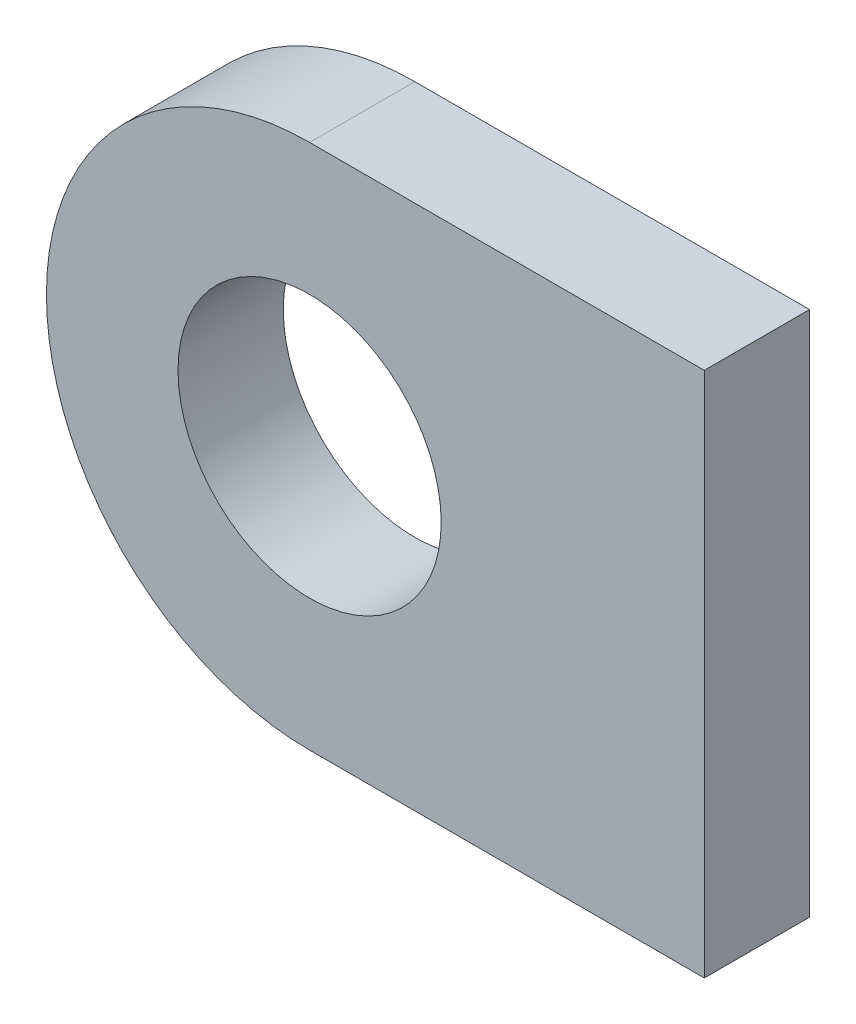
ISO-10303-21;
HEADER;
FILE_DESCRIPTION(('STEP AP214'),'2;1');
FILE_NAME('part.step','',(''),(''),'','','');
FILE_SCHEMA(('AUTOMOTIVE_DESIGN { 1 0 10303 214 1 1 1 1 }'));
ENDSEC;
DATA;
#1=APPLICATION_CONTEXT('core data for automotive mechanical design processes');
#2=APPLICATION_PROTOCOL_DEFINITION('international standard','automotive_design',2000,#1);
#3=PRODUCT_CONTEXT('',#1,'mechanical');
#4=PRODUCT('Part','Part','',(#3));
#5=PRODUCT_RELATED_PRODUCT_CATEGORY('part','',(#4));
#6=PRODUCT_DEFINITION_FORMATION('','',#4);
#7=PRODUCT_DEFINITION_CONTEXT('part definition',#1,'design');
#8=PRODUCT_DEFINITION('design','',#6,#7);
#9=PRODUCT_DEFINITION_SHAPE('','',#8);
#10=(LENGTH_UNIT() NAMED_UNIT(*) SI_UNIT(.MILLI.,.METRE.));
#11=(NAMED_UNIT(*) PLANE_ANGLE_UNIT() SI_UNIT($,.RADIAN.));
#12=(NAMED_UNIT(*) SI_UNIT($,.STERADIAN.) SOLID_ANGLE_UNIT());
#13=UNCERTAINTY_MEASURE_WITH_UNIT(LENGTH_MEASURE(1.E-05),#10,'distance_accuracy_value','');
#14=(GEOMETRIC_REPRESENTATION_CONTEXT(3) GLOBAL_UNCERTAINTY_ASSIGNED_CONTEXT((#13)) GLOBAL_UNIT_ASSIGNED_CONTEXT((#10,
#11,#12)) REPRESENTATION_CONTEXT('',''));
#15=CARTESIAN_POINT('',(0.,0.,0.));
#16=DIRECTION('',(0.,0.,1.));
#17=DIRECTION('',(1.,0.,0.));
#18=AXIS2_PLACEMENT_3D('',#15,#16,#17);
#19=CARTESIAN_POINT('',(0.,0.,4.));
#20=DIRECTION('',(0.,0.,-1.));
#21=DIRECTION('',(-1.,0.,0.));
#22=AXIS2_PLACEMENT_3D('',#19,#20,#21);
#23=CYLINDRICAL_SURFACE('',#22,10.);
#24=CARTESIAN_POINT('',(0.,0.,0.));
#25=DIRECTION('',(0.,0.,1.));
#26=DIRECTION('',(1.,0.,0.));
#27=AXIS2_PLACEMENT_3D('',#24,#25,#26);
#28=CIRCLE('',#27,10.);
#29=CARTESIAN_POINT('',(0.,10.,0.));
#30=VERTEX_POINT('',#29);
#31=CARTESIAN_POINT('',(0.,-10.,0.));
#32=VERTEX_POINT('',#31);
#33=EDGE_CURVE('E114',#30,#32,#28,.T.);
#34=ORIENTED_EDGE('',*,*,#33,.T.);
#35=DIRECTION('',(0.,0.,-1.));
#36=VECTOR('',#35,1.);
#37=CARTESIAN_POINT('',(0.,-10.,4.));
#38=LINE('',#37,#36);
#39=CARTESIAN_POINT('',(0.,-10.,4.));
#40=VERTEX_POINT('',#39);
#41=EDGE_CURVE('E11',#40,#32,#38,.T.);
#42=ORIENTED_EDGE('',*,*,#41,.F.);
#43=CARTESIAN_POINT('',(0.,0.,4.));
#44=DIRECTION('',(0.,0.,1.));
#45=DIRECTION('',(1.,0.,0.));
#46=AXIS2_PLACEMENT_3D('',#43,#44,#45);
#47=CIRCLE('',#46,10.);
#48=CARTESIAN_POINT('',(0.,10.,4.));
#49=VERTEX_POINT('',#48);
#50=EDGE_CURVE('E83',#49,#40,#47,.T.);
#51=ORIENTED_EDGE('',*,*,#50,.F.);
#52=DIRECTION('',(0.,0.,-1.));
#53=VECTOR('',#52,1.);
#54=CARTESIAN_POINT('',(0.,10.,4.));
#55=LINE('',#54,#53);
#56=EDGE_CURVE('E59',#49,#30,#55,.T.);
#57=ORIENTED_EDGE('',*,*,#56,.T.);
#58=EDGE_LOOP('',(#34,#42,#51,#57));
#59=FACE_BOUND('',#58,.T.);
#60=ADVANCED_FACE('F41',(#59),#23,.T.);
#61=CARTESIAN_POINT('',(0.,-10.,4.));
#62=DIRECTION('',(0.,-1.,0.));
#63=DIRECTION('',(0.,0.,-1.));
#64=AXIS2_PLACEMENT_3D('',#61,#62,#63);
#65=PLANE('',#64);
#66=DIRECTION('',(-1.,0.,0.));
#67=VECTOR('',#66,1.);
#68=CARTESIAN_POINT('',(0.,-10.,0.));
#69=LINE('',#68,#67);
#70=CARTESIAN_POINT('',(15.,-10.,0.));
#71=VERTEX_POINT('',#70);
#72=EDGE_CURVE('E92',#71,#32,#69,.T.);
#73=ORIENTED_EDGE('',*,*,#72,.F.);
#74=DIRECTION('',(0.,0.,-1.));
#75=VECTOR('',#74,1.);
#76=CARTESIAN_POINT('',(15.,-10.,4.));
#77=LINE('',#76,#75);
#78=CARTESIAN_POINT('',(15.,-10.,4.));
#79=VERTEX_POINT('',#78);
#80=EDGE_CURVE('E51',#79,#71,#77,.T.);
#81=ORIENTED_EDGE('',*,*,#80,.F.);
#82=DIRECTION('',(-1.,0.,0.));
#83=VECTOR('',#82,1.);
#84=CARTESIAN_POINT('',(0.,-10.,4.));
#85=LINE('',#84,#83);
#86=EDGE_CURVE('E90',#79,#40,#85,.T.);
#87=ORIENTED_EDGE('',*,*,#86,.T.);
#88=ORIENTED_EDGE('',*,*,#41,.T.);
#89=EDGE_LOOP('',(#73,#81,#87,#88));
#90=FACE_BOUND('',#89,.T.);
#91=ADVANCED_FACE('F89',(#90),#65,.T.);
#92=CARTESIAN_POINT('',(15.,0.,4.));
#93=DIRECTION('',(1.,0.,0.));
#94=DIRECTION('',(0.,0.,-1.));
#95=AXIS2_PLACEMENT_3D('',#92,#93,#94);
#96=PLANE('',#95);
#97=DIRECTION('',(0.,-1.,0.));
#98=VECTOR('',#97,1.);
#99=CARTESIAN_POINT('',(15.,0.,0.));
#100=LINE('',#99,#98);
#101=CARTESIAN_POINT('',(15.,10.,0.));
#102=VERTEX_POINT('',#101);
#103=EDGE_CURVE('E119',#102,#71,#100,.T.);
#104=ORIENTED_EDGE('',*,*,#103,.F.);
#105=DIRECTION('',(0.,0.,-1.));
#106=VECTOR('',#105,1.);
#107=CARTESIAN_POINT('',(15.,10.,4.));
#108=LINE('',#107,#106);
#109=CARTESIAN_POINT('',(15.,10.,4.));
#110=VERTEX_POINT('',#109);
#111=EDGE_CURVE('E72',#110,#102,#108,.T.);
#112=ORIENTED_EDGE('',*,*,#111,.F.);
#113=DIRECTION('',(0.,-1.,0.));
#114=VECTOR('',#113,1.);
#115=CARTESIAN_POINT('',(15.,0.,4.));
#116=LINE('',#115,#114);
#117=EDGE_CURVE('E99',#110,#79,#116,.T.);
#118=ORIENTED_EDGE('',*,*,#117,.T.);
#119=ORIENTED_EDGE('',*,*,#80,.T.);
#120=EDGE_LOOP('',(#104,#112,#118,#119));
#121=FACE_BOUND('',#120,.T.);
#122=ADVANCED_FACE('F102',(#121),#96,.T.);
#123=CARTESIAN_POINT('',(0.,0.,4.));
#124=DIRECTION('',(0.,0.,-1.));
#125=DIRECTION('',(-1.,0.,0.));
#126=AXIS2_PLACEMENT_3D('',#123,#124,#125);
#127=CYLINDRICAL_SURFACE('',#126,5.);
#128=CARTESIAN_POINT('',(0.,0.,4.));
#129=DIRECTION('',(0.,0.,1.));
#130=DIRECTION('',(1.,0.,0.));
#131=AXIS2_PLACEMENT_3D('',#128,#129,#130);
#132=CIRCLE('',#131,5.);
#133=CARTESIAN_POINT('',(5.,0.,4.));
#134=VERTEX_POINT('',#133);
#135=EDGE_CURVE('E126',#134,#134,#132,.T.);
#136=ORIENTED_EDGE('',*,*,#135,.T.);
#137=EDGE_LOOP('',(#136));
#138=FACE_BOUND('',#137,.T.);
#139=CARTESIAN_POINT('',(0.,0.,0.));
#140=DIRECTION('',(0.,0.,1.));
#141=DIRECTION('',(1.,0.,0.));
#142=AXIS2_PLACEMENT_3D('',#139,#140,#141);
#143=CIRCLE('',#142,5.);
#144=CARTESIAN_POINT('',(5.,0.,0.));
#145=VERTEX_POINT('',#144);
#146=EDGE_CURVE('E110',#145,#145,#143,.T.);
#147=ORIENTED_EDGE('',*,*,#146,.F.);
#148=EDGE_LOOP('',(#147));
#149=FACE_BOUND('',#148,.T.);
#150=ADVANCED_FACE('F43',(#138,#149),#127,.F.);
#151=CARTESIAN_POINT('',(0.,10.,4.));
#152=DIRECTION('',(0.,1.,0.));
#153=DIRECTION('',(0.,0.,1.));
#154=AXIS2_PLACEMENT_3D('',#151,#152,#153);
#155=PLANE('',#154);
#156=DIRECTION('',(1.,0.,0.));
#157=VECTOR('',#156,1.);
#158=CARTESIAN_POINT('',(0.,10.,0.));
#159=LINE('',#158,#157);
#160=EDGE_CURVE('E122',#30,#102,#159,.T.);
#161=ORIENTED_EDGE('',*,*,#160,.F.);
#162=ORIENTED_EDGE('',*,*,#56,.F.);
#163=DIRECTION('',(1.,0.,0.));
#164=VECTOR('',#163,1.);
#165=CARTESIAN_POINT('',(0.,10.,4.));
#166=LINE('',#165,#164);
#167=EDGE_CURVE('E104',#49,#110,#166,.T.);
#168=ORIENTED_EDGE('',*,*,#167,.T.);
#169=ORIENTED_EDGE('',*,*,#111,.T.);
#170=EDGE_LOOP('',(#161,#162,#168,#169));
#171=FACE_BOUND('',#170,.T.);
#172=ADVANCED_FACE('F141',(#171),#155,.T.);
#173=CARTESIAN_POINT('',(0.,0.,4.));
#174=DIRECTION('',(0.,0.,1.));
#175=DIRECTION('',(1.,0.,0.));
#176=AXIS2_PLACEMENT_3D('',#173,#174,#175);
#177=PLANE('',#176);
#178=ORIENTED_EDGE('',*,*,#135,.F.);
#179=EDGE_LOOP('',(#178));
#180=FACE_BOUND('',#179,.T.);
#181=ORIENTED_EDGE('',*,*,#50,.T.);
#182=ORIENTED_EDGE('',*,*,#86,.F.);
#183=ORIENTED_EDGE('',*,*,#117,.F.);
#184=ORIENTED_EDGE('',*,*,#167,.F.);
#185=EDGE_LOOP('',(#181,#182,#183,#184));
#186=FACE_BOUND('',#185,.T.);
#187=ADVANCED_FACE('F98',(#180,#186),#177,.T.);
#188=CARTESIAN_POINT('',(0.,0.,0.));
#189=DIRECTION('',(0.,0.,1.));
#190=DIRECTION('',(1.,0.,0.));
#191=AXIS2_PLACEMENT_3D('',#188,#189,#190);
#192=PLANE('',#191);
#193=ORIENTED_EDGE('',*,*,#146,.T.);
#194=EDGE_LOOP('',(#193));
#195=FACE_BOUND('',#194,.T.);
#196=ORIENTED_EDGE('',*,*,#33,.F.);
#197=ORIENTED_EDGE('',*,*,#160,.T.);
#198=ORIENTED_EDGE('',*,*,#103,.T.);
#199=ORIENTED_EDGE('',*,*,#72,.T.);
#200=EDGE_LOOP('',(#196,#197,#198,#199));
#201=FACE_BOUND('',#200,.T.);
#202=ADVANCED_FACE('F140',(#195,#201),#192,.F.);
#203=CLOSED_SHELL('',(#60,#91,#122,#150,#172,#187,#202));
#204=MANIFOLD_SOLID_BREP('B2',#203);
#205=ADVANCED_BREP_SHAPE_REPRESENTATION('',(#18,#204),#14);
#206=SHAPE_DEFINITION_REPRESENTATION(#9,#205);
ENDSEC;
END-ISO-10303-21;
